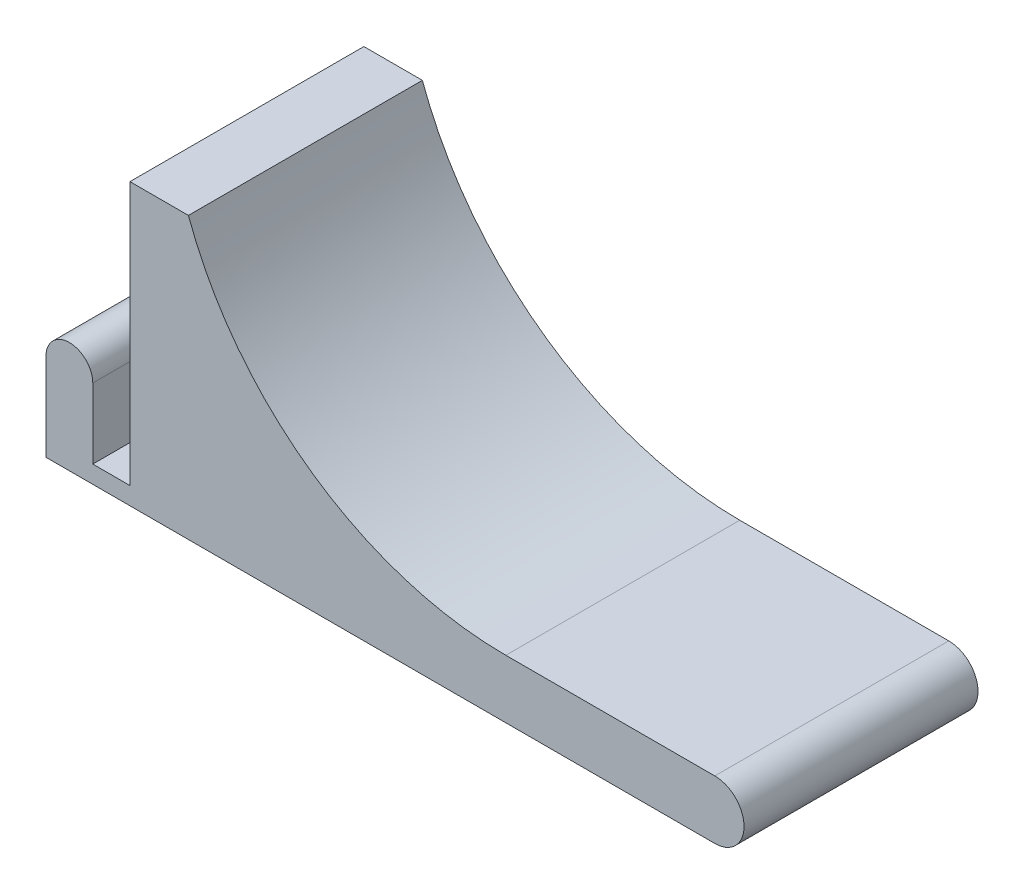
ISO-10303-21;
HEADER;
FILE_DESCRIPTION(('STEP AP214'),'2;1');
FILE_NAME('part.step','',(''),(''),'','','');
FILE_SCHEMA(('AUTOMOTIVE_DESIGN { 1 0 10303 214 1 1 1 1 }'));
ENDSEC;
DATA;
#1=APPLICATION_CONTEXT('core data for automotive mechanical design processes');
#2=APPLICATION_PROTOCOL_DEFINITION('international standard','automotive_design',2000,#1);
#3=PRODUCT_CONTEXT('',#1,'mechanical');
#4=PRODUCT('Part','Part','',(#3));
#5=PRODUCT_RELATED_PRODUCT_CATEGORY('part','',(#4));
#6=PRODUCT_DEFINITION_FORMATION('','',#4);
#7=PRODUCT_DEFINITION_CONTEXT('part definition',#1,'design');
#8=PRODUCT_DEFINITION('design','',#6,#7);
#9=PRODUCT_DEFINITION_SHAPE('','',#8);
#10=(LENGTH_UNIT() NAMED_UNIT(*) SI_UNIT(.MILLI.,.METRE.));
#11=(NAMED_UNIT(*) PLANE_ANGLE_UNIT() SI_UNIT($,.RADIAN.));
#12=(NAMED_UNIT(*) SI_UNIT($,.STERADIAN.) SOLID_ANGLE_UNIT());
#13=UNCERTAINTY_MEASURE_WITH_UNIT(LENGTH_MEASURE(1.E-05),#10,'distance_accuracy_value','');
#14=(GEOMETRIC_REPRESENTATION_CONTEXT(3) GLOBAL_UNCERTAINTY_ASSIGNED_CONTEXT((#13)) GLOBAL_UNIT_ASSIGNED_CONTEXT((#10,
#11,#12)) REPRESENTATION_CONTEXT('',''));
#15=CARTESIAN_POINT('',(0.,0.,0.));
#16=DIRECTION('',(0.,0.,1.));
#17=DIRECTION('',(1.,0.,0.));
#18=AXIS2_PLACEMENT_3D('',#15,#16,#17);
#19=CARTESIAN_POINT('',(4.,15.,40.));
#20=DIRECTION('',(0.,0.,-1.));
#21=DIRECTION('',(-1.,0.,0.));
#22=AXIS2_PLACEMENT_3D('',#19,#20,#21);
#23=CYLINDRICAL_SURFACE('',#22,4.);
#24=CARTESIAN_POINT('',(4.,15.,0.));
#25=DIRECTION('',(0.,0.,1.));
#26=DIRECTION('',(1.,0.,0.));
#27=AXIS2_PLACEMENT_3D('',#24,#25,#26);
#28=CIRCLE('',#27,4.);
#29=CARTESIAN_POINT('',(8.,15.,0.));
#30=VERTEX_POINT('',#29);
#31=CARTESIAN_POINT('',(0.,15.,0.));
#32=VERTEX_POINT('',#31);
#33=EDGE_CURVE('E147',#30,#32,#28,.T.);
#34=ORIENTED_EDGE('',*,*,#33,.T.);
#35=DIRECTION('',(0.,0.,-1.));
#36=VECTOR('',#35,1.);
#37=CARTESIAN_POINT('',(0.,15.,40.));
#38=LINE('',#37,#36);
#39=CARTESIAN_POINT('',(0.,15.,40.));
#40=VERTEX_POINT('',#39);
#41=EDGE_CURVE('E11',#40,#32,#38,.T.);
#42=ORIENTED_EDGE('',*,*,#41,.F.);
#43=CARTESIAN_POINT('',(4.,15.,40.));
#44=DIRECTION('',(0.,0.,1.));
#45=DIRECTION('',(1.,0.,0.));
#46=AXIS2_PLACEMENT_3D('',#43,#44,#45);
#47=CIRCLE('',#46,4.);
#48=CARTESIAN_POINT('',(8.,15.,40.));
#49=VERTEX_POINT('',#48);
#50=EDGE_CURVE('E165',#49,#40,#47,.T.);
#51=ORIENTED_EDGE('',*,*,#50,.F.);
#52=DIRECTION('',(0.,0.,-1.));
#53=VECTOR('',#52,1.);
#54=CARTESIAN_POINT('',(8.,15.,40.));
#55=LINE('',#54,#53);
#56=EDGE_CURVE('E143',#49,#30,#55,.T.);
#57=ORIENTED_EDGE('',*,*,#56,.T.);
#58=EDGE_LOOP('',(#34,#42,#51,#57));
#59=FACE_BOUND('',#58,.T.);
#60=ADVANCED_FACE('F39',(#59),#23,.T.);
#61=CARTESIAN_POINT('',(0.,15.,40.));
#62=DIRECTION('',(1.,0.,0.));
#63=DIRECTION('',(0.,1.,0.));
#64=AXIS2_PLACEMENT_3D('',#61,#62,#63);
#65=PLANE('',#64);
#66=DIRECTION('',(0.,-1.,0.));
#67=VECTOR('',#66,1.);
#68=CARTESIAN_POINT('',(0.,15.,0.));
#69=LINE('',#68,#67);
#70=CARTESIAN_POINT('',(0.,0.,0.));
#71=VERTEX_POINT('',#70);
#72=EDGE_CURVE('E150',#32,#71,#69,.T.);
#73=ORIENTED_EDGE('',*,*,#72,.T.);
#74=DIRECTION('',(0.,0.,-1.));
#75=VECTOR('',#74,1.);
#76=CARTESIAN_POINT('',(0.,0.,40.));
#77=LINE('',#76,#75);
#78=CARTESIAN_POINT('',(0.,0.,40.));
#79=VERTEX_POINT('',#78);
#80=EDGE_CURVE('E47',#79,#71,#77,.T.);
#81=ORIENTED_EDGE('',*,*,#80,.F.);
#82=DIRECTION('',(0.,-1.,0.));
#83=VECTOR('',#82,1.);
#84=CARTESIAN_POINT('',(0.,15.,40.));
#85=LINE('',#84,#83);
#86=EDGE_CURVE('E104',#40,#79,#85,.T.);
#87=ORIENTED_EDGE('',*,*,#86,.F.);
#88=ORIENTED_EDGE('',*,*,#41,.T.);
#89=EDGE_LOOP('',(#73,#81,#87,#88));
#90=FACE_BOUND('',#89,.T.);
#91=ADVANCED_FACE('F214',(#90),#65,.F.);
#92=CARTESIAN_POINT('',(0.,0.,40.));
#93=DIRECTION('',(0.,1.,0.));
#94=DIRECTION('',(0.,0.,1.));
#95=AXIS2_PLACEMENT_3D('',#92,#93,#94);
#96=PLANE('',#95);
#97=DIRECTION('',(1.,0.,0.));
#98=VECTOR('',#97,1.);
#99=CARTESIAN_POINT('',(0.,0.,0.));
#100=LINE('',#99,#98);
#101=CARTESIAN_POINT('',(114.35,0.,0.));
#102=VERTEX_POINT('',#101);
#103=EDGE_CURVE('E152',#71,#102,#100,.T.);
#104=ORIENTED_EDGE('',*,*,#103,.T.);
#105=DIRECTION('',(0.,0.,-1.));
#106=VECTOR('',#105,1.);
#107=CARTESIAN_POINT('',(114.35,0.,40.));
#108=LINE('',#107,#106);
#109=CARTESIAN_POINT('',(114.35,0.,40.));
#110=VERTEX_POINT('',#109);
#111=EDGE_CURVE('E178',#110,#102,#108,.T.);
#112=ORIENTED_EDGE('',*,*,#111,.F.);
#113=DIRECTION('',(1.,0.,0.));
#114=VECTOR('',#113,1.);
#115=CARTESIAN_POINT('',(0.,0.,40.));
#116=LINE('',#115,#114);
#117=EDGE_CURVE('E186',#79,#110,#116,.T.);
#118=ORIENTED_EDGE('',*,*,#117,.F.);
#119=ORIENTED_EDGE('',*,*,#80,.T.);
#120=EDGE_LOOP('',(#104,#112,#118,#119));
#121=FACE_BOUND('',#120,.T.);
#122=ADVANCED_FACE('F184',(#121),#96,.F.);
#123=CARTESIAN_POINT('',(114.35,5.00000000000002,40.));
#124=DIRECTION('',(0.,0.,-1.));
#125=DIRECTION('',(-1.,0.,0.));
#126=AXIS2_PLACEMENT_3D('',#123,#124,#125);
#127=CYLINDRICAL_SURFACE('',#126,5.00000000000002);
#128=CARTESIAN_POINT('',(114.35,5.00000000000002,0.));
#129=DIRECTION('',(0.,0.,1.));
#130=DIRECTION('',(1.,0.,0.));
#131=AXIS2_PLACEMENT_3D('',#128,#129,#130);
#132=CIRCLE('',#131,5.00000000000002);
#133=CARTESIAN_POINT('',(114.35,10.,0.));
#134=VERTEX_POINT('',#133);
#135=EDGE_CURVE('E154',#102,#134,#132,.T.);
#136=ORIENTED_EDGE('',*,*,#135,.T.);
#137=DIRECTION('',(0.,0.,-1.));
#138=VECTOR('',#137,1.);
#139=CARTESIAN_POINT('',(114.35,10.,40.));
#140=LINE('',#139,#138);
#141=CARTESIAN_POINT('',(114.35,10.,40.));
#142=VERTEX_POINT('',#141);
#143=EDGE_CURVE('E175',#142,#134,#140,.T.);
#144=ORIENTED_EDGE('',*,*,#143,.F.);
#145=CARTESIAN_POINT('',(114.35,5.00000000000002,40.));
#146=DIRECTION('',(0.,0.,1.));
#147=DIRECTION('',(1.,0.,0.));
#148=AXIS2_PLACEMENT_3D('',#145,#146,#147);
#149=CIRCLE('',#148,5.00000000000002);
#150=EDGE_CURVE('E204',#110,#142,#149,.T.);
#151=ORIENTED_EDGE('',*,*,#150,.F.);
#152=ORIENTED_EDGE('',*,*,#111,.T.);
#153=EDGE_LOOP('',(#136,#144,#151,#152));
#154=FACE_BOUND('',#153,.T.);
#155=ADVANCED_FACE('F195',(#154),#127,.T.);
#156=CARTESIAN_POINT('',(114.35,10.,40.));
#157=DIRECTION('',(0.,-1.,0.));
#158=DIRECTION('',(1.,0.,0.));
#159=AXIS2_PLACEMENT_3D('',#156,#157,#158);
#160=PLANE('',#159);
#161=DIRECTION('',(-1.,0.,0.));
#162=VECTOR('',#161,1.);
#163=CARTESIAN_POINT('',(114.35,10.,0.));
#164=LINE('',#163,#162);
#165=CARTESIAN_POINT('',(78.6196242562004,10.,0.));
#166=VERTEX_POINT('',#165);
#167=EDGE_CURVE('E156',#134,#166,#164,.T.);
#168=ORIENTED_EDGE('',*,*,#167,.T.);
#169=DIRECTION('',(0.,0.,-1.));
#170=VECTOR('',#169,1.);
#171=CARTESIAN_POINT('',(78.6196242562004,10.,40.));
#172=LINE('',#171,#170);
#173=CARTESIAN_POINT('',(78.6196242562004,10.,40.));
#174=VERTEX_POINT('',#173);
#175=EDGE_CURVE('E172',#174,#166,#172,.T.);
#176=ORIENTED_EDGE('',*,*,#175,.F.);
#177=DIRECTION('',(-1.,0.,0.));
#178=VECTOR('',#177,1.);
#179=CARTESIAN_POINT('',(114.35,10.,40.));
#180=LINE('',#179,#178);
#181=EDGE_CURVE('E201',#142,#174,#180,.T.);
#182=ORIENTED_EDGE('',*,*,#181,.F.);
#183=ORIENTED_EDGE('',*,*,#143,.T.);
#184=EDGE_LOOP('',(#168,#176,#182,#183));
#185=FACE_BOUND('',#184,.T.);
#186=ADVANCED_FACE('F199',(#185),#160,.F.);
#187=CARTESIAN_POINT('',(78.6196242562004,67.7525278540681,40.));
#188=DIRECTION('',(0.,0.,-1.));
#189=DIRECTION('',(-1.,0.,0.));
#190=AXIS2_PLACEMENT_3D('',#187,#188,#189);
#191=CYLINDRICAL_SURFACE('',#190,57.7525278540681);
#192=CARTESIAN_POINT('',(78.6196242562004,67.7525278540681,0.));
#193=DIRECTION('',(0.,0.,-1.));
#194=DIRECTION('',(-1.,0.,0.));
#195=AXIS2_PLACEMENT_3D('',#192,#193,#194);
#196=CIRCLE('',#195,57.7525278540681);
#197=CARTESIAN_POINT('',(24.35,48.,0.));
#198=VERTEX_POINT('',#197);
#199=EDGE_CURVE('E158',#166,#198,#196,.T.);
#200=ORIENTED_EDGE('',*,*,#199,.T.);
#201=DIRECTION('',(0.,0.,-1.));
#202=VECTOR('',#201,1.);
#203=CARTESIAN_POINT('',(24.35,48.,40.));
#204=LINE('',#203,#202);
#205=CARTESIAN_POINT('',(24.35,48.,40.));
#206=VERTEX_POINT('',#205);
#207=EDGE_CURVE('E169',#206,#198,#204,.T.);
#208=ORIENTED_EDGE('',*,*,#207,.F.);
#209=CARTESIAN_POINT('',(78.6196242562004,67.7525278540681,40.));
#210=DIRECTION('',(0.,0.,-1.));
#211=DIRECTION('',(-1.,0.,0.));
#212=AXIS2_PLACEMENT_3D('',#209,#210,#211);
#213=CIRCLE('',#212,57.7525278540681);
#214=EDGE_CURVE('E203',#174,#206,#213,.T.);
#215=ORIENTED_EDGE('',*,*,#214,.F.);
#216=ORIENTED_EDGE('',*,*,#175,.T.);
#217=EDGE_LOOP('',(#200,#208,#215,#216));
#218=FACE_BOUND('',#217,.T.);
#219=ADVANCED_FACE('F226',(#218),#191,.F.);
#220=CARTESIAN_POINT('',(14.35,48.,40.));
#221=DIRECTION('',(0.,-1.,0.));
#222=DIRECTION('',(1.,0.,0.));
#223=AXIS2_PLACEMENT_3D('',#220,#221,#222);
#224=PLANE('',#223);
#225=DIRECTION('',(-1.,0.,0.));
#226=VECTOR('',#225,1.);
#227=CARTESIAN_POINT('',(14.35,48.,0.));
#228=LINE('',#227,#226);
#229=CARTESIAN_POINT('',(14.35,48.,0.));
#230=VERTEX_POINT('',#229);
#231=EDGE_CURVE('E160',#198,#230,#228,.T.);
#232=ORIENTED_EDGE('',*,*,#231,.T.);
#233=DIRECTION('',(0.,0.,-1.));
#234=VECTOR('',#233,1.);
#235=CARTESIAN_POINT('',(14.35,48.,40.));
#236=LINE('',#235,#234);
#237=CARTESIAN_POINT('',(14.35,48.,40.));
#238=VERTEX_POINT('',#237);
#239=EDGE_CURVE('E138',#238,#230,#236,.T.);
#240=ORIENTED_EDGE('',*,*,#239,.F.);
#241=DIRECTION('',(-1.,0.,0.));
#242=VECTOR('',#241,1.);
#243=CARTESIAN_POINT('',(14.35,48.,40.));
#244=LINE('',#243,#242);
#245=EDGE_CURVE('E129',#206,#238,#244,.T.);
#246=ORIENTED_EDGE('',*,*,#245,.F.);
#247=ORIENTED_EDGE('',*,*,#207,.T.);
#248=EDGE_LOOP('',(#232,#240,#246,#247));
#249=FACE_BOUND('',#248,.T.);
#250=ADVANCED_FACE('F229',(#249),#224,.F.);
#251=CARTESIAN_POINT('',(14.35,48.,40.));
#252=DIRECTION('',(1.,0.,0.));
#253=DIRECTION('',(0.,1.,0.));
#254=AXIS2_PLACEMENT_3D('',#251,#252,#253);
#255=PLANE('',#254);
#256=DIRECTION('',(0.,-1.,0.));
#257=VECTOR('',#256,1.);
#258=CARTESIAN_POINT('',(14.35,48.,0.));
#259=LINE('',#258,#257);
#260=CARTESIAN_POINT('',(14.35,3.,0.));
#261=VERTEX_POINT('',#260);
#262=EDGE_CURVE('E137',#230,#261,#259,.T.);
#263=ORIENTED_EDGE('',*,*,#262,.T.);
#264=DIRECTION('',(0.,0.,-1.));
#265=VECTOR('',#264,1.);
#266=CARTESIAN_POINT('',(14.35,3.,40.));
#267=LINE('',#266,#265);
#268=CARTESIAN_POINT('',(14.35,3.,40.));
#269=VERTEX_POINT('',#268);
#270=EDGE_CURVE('E134',#269,#261,#267,.T.);
#271=ORIENTED_EDGE('',*,*,#270,.F.);
#272=DIRECTION('',(0.,-1.,0.));
#273=VECTOR('',#272,1.);
#274=CARTESIAN_POINT('',(14.35,48.,40.));
#275=LINE('',#274,#273);
#276=EDGE_CURVE('E123',#238,#269,#275,.T.);
#277=ORIENTED_EDGE('',*,*,#276,.F.);
#278=ORIENTED_EDGE('',*,*,#239,.T.);
#279=EDGE_LOOP('',(#263,#271,#277,#278));
#280=FACE_BOUND('',#279,.T.);
#281=ADVANCED_FACE('F135',(#280),#255,.F.);
#282=CARTESIAN_POINT('',(14.35,3.,40.));
#283=DIRECTION('',(0.,-1.,0.));
#284=DIRECTION('',(1.,0.,0.));
#285=AXIS2_PLACEMENT_3D('',#282,#283,#284);
#286=PLANE('',#285);
#287=DIRECTION('',(-1.,0.,0.));
#288=VECTOR('',#287,1.);
#289=CARTESIAN_POINT('',(14.35,3.,0.));
#290=LINE('',#289,#288);
#291=CARTESIAN_POINT('',(8.,3.,0.));
#292=VERTEX_POINT('',#291);
#293=EDGE_CURVE('E90',#261,#292,#290,.T.);
#294=ORIENTED_EDGE('',*,*,#293,.T.);
#295=DIRECTION('',(0.,0.,-1.));
#296=VECTOR('',#295,1.);
#297=CARTESIAN_POINT('',(8.,3.,40.));
#298=LINE('',#297,#296);
#299=CARTESIAN_POINT('',(8.,3.,40.));
#300=VERTEX_POINT('',#299);
#301=EDGE_CURVE('E139',#300,#292,#298,.T.);
#302=ORIENTED_EDGE('',*,*,#301,.F.);
#303=DIRECTION('',(-1.,0.,0.));
#304=VECTOR('',#303,1.);
#305=CARTESIAN_POINT('',(14.35,3.,40.));
#306=LINE('',#305,#304);
#307=EDGE_CURVE('E127',#269,#300,#306,.T.);
#308=ORIENTED_EDGE('',*,*,#307,.F.);
#309=ORIENTED_EDGE('',*,*,#270,.T.);
#310=EDGE_LOOP('',(#294,#302,#308,#309));
#311=FACE_BOUND('',#310,.T.);
#312=ADVANCED_FACE('F141',(#311),#286,.F.);
#313=CARTESIAN_POINT('',(8.,3.,40.));
#314=DIRECTION('',(-1.,0.,0.));
#315=DIRECTION('',(0.,-1.,0.));
#316=AXIS2_PLACEMENT_3D('',#313,#314,#315);
#317=PLANE('',#316);
#318=DIRECTION('',(0.,1.,0.));
#319=VECTOR('',#318,1.);
#320=CARTESIAN_POINT('',(8.,3.,0.));
#321=LINE('',#320,#319);
#322=EDGE_CURVE('E96',#292,#30,#321,.T.);
#323=ORIENTED_EDGE('',*,*,#322,.T.);
#324=ORIENTED_EDGE('',*,*,#56,.F.);
#325=DIRECTION('',(0.,1.,0.));
#326=VECTOR('',#325,1.);
#327=CARTESIAN_POINT('',(8.,3.,40.));
#328=LINE('',#327,#326);
#329=EDGE_CURVE('E55',#300,#49,#328,.T.);
#330=ORIENTED_EDGE('',*,*,#329,.F.);
#331=ORIENTED_EDGE('',*,*,#301,.T.);
#332=EDGE_LOOP('',(#323,#324,#330,#331));
#333=FACE_BOUND('',#332,.T.);
#334=ADVANCED_FACE('F238',(#333),#317,.F.);
#335=CARTESIAN_POINT('',(4.,15.,40.));
#336=DIRECTION('',(0.,0.,1.));
#337=DIRECTION('',(1.,0.,0.));
#338=AXIS2_PLACEMENT_3D('',#335,#336,#337);
#339=PLANE('',#338);
#340=ORIENTED_EDGE('',*,*,#50,.T.);
#341=ORIENTED_EDGE('',*,*,#86,.T.);
#342=ORIENTED_EDGE('',*,*,#117,.T.);
#343=ORIENTED_EDGE('',*,*,#150,.T.);
#344=ORIENTED_EDGE('',*,*,#181,.T.);
#345=ORIENTED_EDGE('',*,*,#214,.T.);
#346=ORIENTED_EDGE('',*,*,#245,.T.);
#347=ORIENTED_EDGE('',*,*,#276,.T.);
#348=ORIENTED_EDGE('',*,*,#307,.T.);
#349=ORIENTED_EDGE('',*,*,#329,.T.);
#350=EDGE_LOOP('',(#340,#341,#342,#343,#344,#345,#346,#347,#348,#349));
#351=FACE_BOUND('',#350,.T.);
#352=ADVANCED_FACE('F125',(#351),#339,.T.);
#353=CARTESIAN_POINT('',(4.,15.,0.));
#354=DIRECTION('',(0.,0.,1.));
#355=DIRECTION('',(1.,0.,0.));
#356=AXIS2_PLACEMENT_3D('',#353,#354,#355);
#357=PLANE('',#356);
#358=ORIENTED_EDGE('',*,*,#33,.F.);
#359=ORIENTED_EDGE('',*,*,#322,.F.);
#360=ORIENTED_EDGE('',*,*,#293,.F.);
#361=ORIENTED_EDGE('',*,*,#262,.F.);
#362=ORIENTED_EDGE('',*,*,#231,.F.);
#363=ORIENTED_EDGE('',*,*,#199,.F.);
#364=ORIENTED_EDGE('',*,*,#167,.F.);
#365=ORIENTED_EDGE('',*,*,#135,.F.);
#366=ORIENTED_EDGE('',*,*,#103,.F.);
#367=ORIENTED_EDGE('',*,*,#72,.F.);
#368=EDGE_LOOP('',(#358,#359,#360,#361,#362,#363,#364,#365,#366,#367));
#369=FACE_BOUND('',#368,.T.);
#370=ADVANCED_FACE('F190',(#369),#357,.F.);
#371=CLOSED_SHELL('',(#60,#91,#122,#155,#186,#219,#250,#281,#312,#334,#352,#370));
#372=MANIFOLD_SOLID_BREP('B2',#371);
#373=ADVANCED_BREP_SHAPE_REPRESENTATION('',(#18,#372),#14);
#374=SHAPE_DEFINITION_REPRESENTATION(#9,#373);
ENDSEC;
END-ISO-10303-21;
